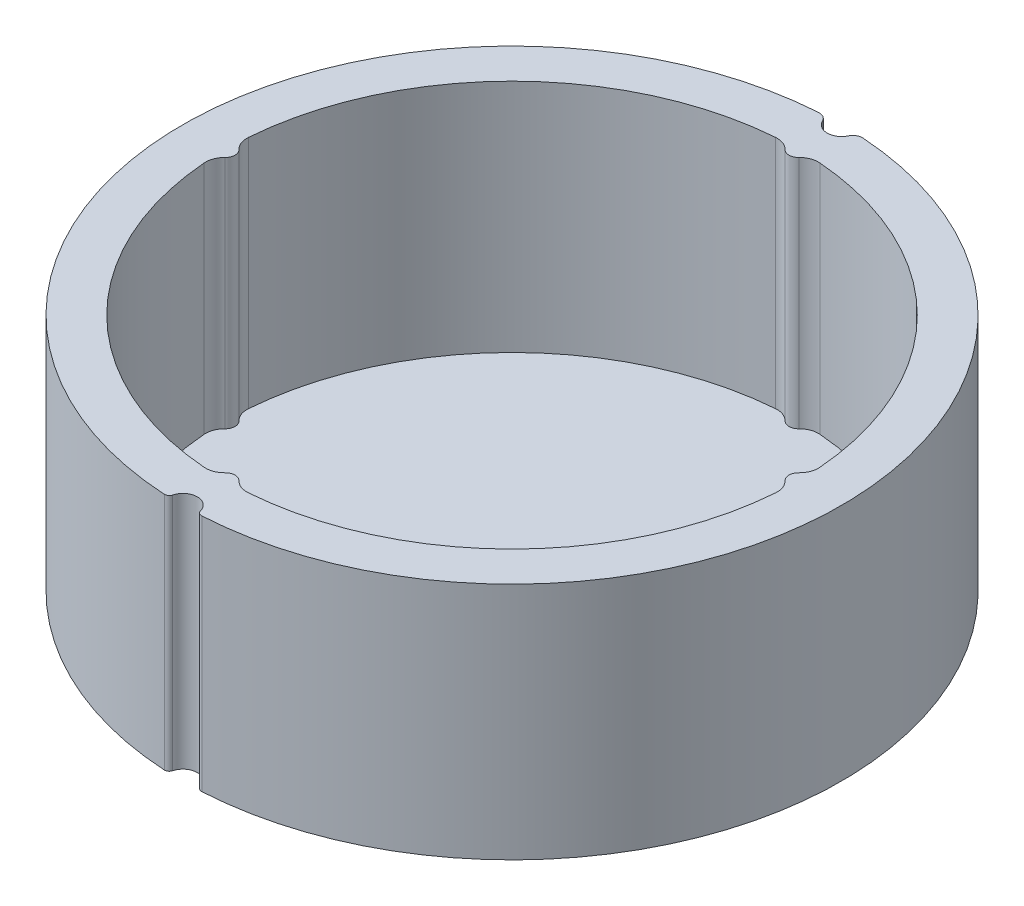
ISO-10303-21;
HEADER;
FILE_DESCRIPTION(('STEP AP214'),'2;1');
FILE_NAME('part.step','',(''),(''),'','','');
FILE_SCHEMA(('AUTOMOTIVE_DESIGN { 1 0 10303 214 1 1 1 1 }'));
ENDSEC;
DATA;
#1=APPLICATION_CONTEXT('core data for automotive mechanical design processes');
#2=APPLICATION_PROTOCOL_DEFINITION('international standard','automotive_design',2000,#1);
#3=PRODUCT_CONTEXT('',#1,'mechanical');
#4=PRODUCT('Part','Part','',(#3));
#5=PRODUCT_RELATED_PRODUCT_CATEGORY('part','',(#4));
#6=PRODUCT_DEFINITION_FORMATION('','',#4);
#7=PRODUCT_DEFINITION_CONTEXT('part definition',#1,'design');
#8=PRODUCT_DEFINITION('design','',#6,#7);
#9=PRODUCT_DEFINITION_SHAPE('','',#8);
#10=(LENGTH_UNIT() NAMED_UNIT(*) SI_UNIT(.MILLI.,.METRE.));
#11=(NAMED_UNIT(*) PLANE_ANGLE_UNIT() SI_UNIT($,.RADIAN.));
#12=(NAMED_UNIT(*) SI_UNIT($,.STERADIAN.) SOLID_ANGLE_UNIT());
#13=UNCERTAINTY_MEASURE_WITH_UNIT(LENGTH_MEASURE(1.E-05),#10,'distance_accuracy_value','');
#14=(GEOMETRIC_REPRESENTATION_CONTEXT(3) GLOBAL_UNCERTAINTY_ASSIGNED_CONTEXT((#13)) GLOBAL_UNIT_ASSIGNED_CONTEXT((#10,
#11,#12)) REPRESENTATION_CONTEXT('',''));
#15=CARTESIAN_POINT('',(0.,0.,0.));
#16=DIRECTION('',(0.,0.,1.));
#17=DIRECTION('',(1.,0.,0.));
#18=AXIS2_PLACEMENT_3D('',#15,#16,#17);
#19=CARTESIAN_POINT('',(0.,25.,0.));
#20=DIRECTION('',(0.,1.,0.));
#21=DIRECTION('',(0.,0.,1.));
#22=AXIS2_PLACEMENT_3D('',#19,#20,#21);
#23=PLANE('',#22);
#24=CARTESIAN_POINT('',(-1.93575856721061,25.,33.9428491683965));
#25=DIRECTION('',(0.,1.,0.));
#26=DIRECTION('',(0.,0.,1.));
#27=AXIS2_PLACEMENT_3D('',#24,#25,#26);
#28=CIRCLE('',#27,0.500000000000003);
#29=CARTESIAN_POINT('',(-1.45181892540796,25.,34.0685568574689));
#30=VERTEX_POINT('',#29);
#31=CARTESIAN_POINT('',(-1.96422560496371,25.,34.4420381383884));
#32=VERTEX_POINT('',#31);
#33=EDGE_CURVE('E338',#30,#32,#28,.F.);
#34=ORIENTED_EDGE('',*,*,#33,.F.);
#35=CARTESIAN_POINT('',(0.,25.,34.4456799246862));
#36=DIRECTION('',(0.,1.,0.));
#37=DIRECTION('',(0.,0.,1.));
#38=AXIS2_PLACEMENT_3D('',#35,#36,#37);
#39=CIRCLE('',#38,1.50000000000002);
#40=CARTESIAN_POINT('',(1.45181892540796,25.,34.0685568574689));
#41=VERTEX_POINT('',#40);
#42=EDGE_CURVE('E342',#41,#30,#39,.T.);
#43=ORIENTED_EDGE('',*,*,#42,.F.);
#44=CARTESIAN_POINT('',(1.93575856721061,25.,33.9428491683965));
#45=DIRECTION('',(0.,1.,0.));
#46=DIRECTION('',(0.,0.,1.));
#47=AXIS2_PLACEMENT_3D('',#44,#45,#46);
#48=CIRCLE('',#47,0.500000000000003);
#49=CARTESIAN_POINT('',(1.9642256049637,25.,34.4420381383884));
#50=VERTEX_POINT('',#49);
#51=EDGE_CURVE('E347',#41,#50,#48,.T.);
#52=ORIENTED_EDGE('',*,*,#51,.T.);
#53=CARTESIAN_POINT('',(0.,25.,-0.0020007910519898));
#54=DIRECTION('',(0.,1.,0.));
#55=DIRECTION('',(0.,0.,1.));
#56=AXIS2_PLACEMENT_3D('',#53,#54,#55);
#57=CIRCLE('',#56,34.5);
#58=CARTESIAN_POINT('',(2.32413582105506,25.,-34.4236276074198));
#59=VERTEX_POINT('',#58);
#60=EDGE_CURVE('E350',#50,#59,#57,.T.);
#61=ORIENTED_EDGE('',*,*,#60,.T.);
#62=CARTESIAN_POINT('',(2.2567695653723,25.,-33.4258992939019));
#63=DIRECTION('',(0.,1.,0.));
#64=DIRECTION('',(0.,0.,1.));
#65=AXIS2_PLACEMENT_3D('',#62,#63,#64);
#66=CIRCLE('',#65,1.);
#67=CARTESIAN_POINT('',(1.35406173922335,25.,-33.8561533823304));
#68=VERTEX_POINT('',#67);
#69=EDGE_CURVE('E353',#68,#59,#66,.F.);
#70=ORIENTED_EDGE('',*,*,#69,.F.);
#71=CARTESIAN_POINT('',(0.,25.,-34.5015345149731));
#72=DIRECTION('',(0.,1.,0.));
#73=DIRECTION('',(0.,0.,1.));
#74=AXIS2_PLACEMENT_3D('',#71,#72,#73);
#75=CIRCLE('',#74,1.49999999999991);
#76=CARTESIAN_POINT('',(-1.35406173922335,25.,-33.8561533823304));
#77=VERTEX_POINT('',#76);
#78=EDGE_CURVE('E357',#77,#68,#75,.T.);
#79=ORIENTED_EDGE('',*,*,#78,.F.);
#80=CARTESIAN_POINT('',(-2.2567695653723,25.,-33.4258992939019));
#81=DIRECTION('',(0.,1.,0.));
#82=DIRECTION('',(0.,0.,1.));
#83=AXIS2_PLACEMENT_3D('',#80,#81,#82);
#84=CIRCLE('',#83,1.);
#85=CARTESIAN_POINT('',(-2.32413582105505,25.,-34.4236276074198));
#86=VERTEX_POINT('',#85);
#87=EDGE_CURVE('E361',#77,#86,#84,.T.);
#88=ORIENTED_EDGE('',*,*,#87,.T.);
#89=CARTESIAN_POINT('',(0.,25.,-0.0020007910519898));
#90=DIRECTION('',(0.,1.,0.));
#91=DIRECTION('',(0.,0.,1.));
#92=AXIS2_PLACEMENT_3D('',#89,#90,#91);
#93=CIRCLE('',#92,34.5);
#94=EDGE_CURVE('E364',#86,#32,#93,.T.);
#95=ORIENTED_EDGE('',*,*,#94,.T.);
#96=EDGE_LOOP('',(#34,#43,#52,#61,#70,#79,#88,#95));
#97=FACE_BOUND('',#96,.T.);
#98=CARTESIAN_POINT('',(0.,25.,0.));
#99=DIRECTION('',(0.,1.,0.));
#100=DIRECTION('',(0.,0.,1.));
#101=AXIS2_PLACEMENT_3D('',#98,#99,#100);
#102=CIRCLE('',#101,30.);
#103=CARTESIAN_POINT('',(-29.9107142857143,25.,2.31282747267653));
#104=VERTEX_POINT('',#103);
#105=CARTESIAN_POINT('',(-2.31282747267654,25.,29.9107142857143));
#106=VERTEX_POINT('',#105);
#107=EDGE_CURVE('E233',#104,#106,#102,.T.);
#108=ORIENTED_EDGE('',*,*,#107,.F.);
#109=CARTESIAN_POINT('',(-27.9166666666667,25.,2.1586389744981));
#110=DIRECTION('',(0.,1.,0.));
#111=DIRECTION('',(0.,0.,1.));
#112=AXIS2_PLACEMENT_3D('',#109,#110,#111);
#113=CIRCLE('',#112,2.);
#114=CARTESIAN_POINT('',(-29.3055555555556,25.,0.7195463248327));
#115=VERTEX_POINT('',#114);
#116=EDGE_CURVE('E229',#115,#104,#113,.T.);
#117=ORIENTED_EDGE('',*,*,#116,.F.);
#118=CARTESIAN_POINT('',(-30.,25.,0.));
#119=DIRECTION('',(0.,-1.,0.));
#120=DIRECTION('',(0.,0.,1.));
#121=AXIS2_PLACEMENT_3D('',#118,#119,#120);
#122=CIRCLE('',#121,1.);
#123=CARTESIAN_POINT('',(-29.3055555555556,25.,-0.7195463248327));
#124=VERTEX_POINT('',#123);
#125=EDGE_CURVE('E211',#124,#115,#122,.T.);
#126=ORIENTED_EDGE('',*,*,#125,.F.);
#127=CARTESIAN_POINT('',(-27.9166666666667,25.,-2.1586389744981));
#128=DIRECTION('',(0.,1.,0.));
#129=DIRECTION('',(0.,0.,-1.));
#130=AXIS2_PLACEMENT_3D('',#127,#128,#129);
#131=CIRCLE('',#130,2.);
#132=CARTESIAN_POINT('',(-29.9107142857143,25.,-2.31282747267654));
#133=VERTEX_POINT('',#132);
#134=EDGE_CURVE('E277',#133,#124,#131,.T.);
#135=ORIENTED_EDGE('',*,*,#134,.F.);
#136=CARTESIAN_POINT('',(0.,25.,0.));
#137=DIRECTION('',(0.,1.,0.));
#138=DIRECTION('',(0.,0.,1.));
#139=AXIS2_PLACEMENT_3D('',#136,#137,#138);
#140=CIRCLE('',#139,30.);
#141=CARTESIAN_POINT('',(-2.31282747267652,25.,-29.9107142857143));
#142=VERTEX_POINT('',#141);
#143=EDGE_CURVE('E274',#142,#133,#140,.T.);
#144=ORIENTED_EDGE('',*,*,#143,.F.);
#145=CARTESIAN_POINT('',(-2.1586389744981,25.,-27.9166666666667));
#146=DIRECTION('',(0.,1.,0.));
#147=DIRECTION('',(0.,0.,1.));
#148=AXIS2_PLACEMENT_3D('',#145,#146,#147);
#149=CIRCLE('',#148,2.);
#150=CARTESIAN_POINT('',(-0.719546324832698,25.,-29.3055555555556));
#151=VERTEX_POINT('',#150);
#152=EDGE_CURVE('E271',#151,#142,#149,.T.);
#153=ORIENTED_EDGE('',*,*,#152,.F.);
#154=CARTESIAN_POINT('',(0.,25.,-30.));
#155=DIRECTION('',(0.,-1.,0.));
#156=DIRECTION('',(0.,0.,1.));
#157=AXIS2_PLACEMENT_3D('',#154,#155,#156);
#158=CIRCLE('',#157,1.);
#159=CARTESIAN_POINT('',(0.7195463248327,25.,-29.3055555555556));
#160=VERTEX_POINT('',#159);
#161=EDGE_CURVE('E268',#160,#151,#158,.T.);
#162=ORIENTED_EDGE('',*,*,#161,.F.);
#163=CARTESIAN_POINT('',(2.1586389744981,25.,-27.9166666666667));
#164=DIRECTION('',(0.,1.,0.));
#165=DIRECTION('',(0.,0.,-1.));
#166=AXIS2_PLACEMENT_3D('',#163,#164,#165);
#167=CIRCLE('',#166,2.);
#168=CARTESIAN_POINT('',(2.31282747267654,25.,-29.9107142857143));
#169=VERTEX_POINT('',#168);
#170=EDGE_CURVE('E265',#169,#160,#167,.T.);
#171=ORIENTED_EDGE('',*,*,#170,.F.);
#172=CARTESIAN_POINT('',(0.,25.,0.));
#173=DIRECTION('',(0.,1.,0.));
#174=DIRECTION('',(0.,0.,1.));
#175=AXIS2_PLACEMENT_3D('',#172,#173,#174);
#176=CIRCLE('',#175,30.);
#177=CARTESIAN_POINT('',(29.9107142857143,25.,-2.31282747267654));
#178=VERTEX_POINT('',#177);
#179=EDGE_CURVE('E262',#178,#169,#176,.T.);
#180=ORIENTED_EDGE('',*,*,#179,.F.);
#181=CARTESIAN_POINT('',(27.9166666666667,25.,-2.1586389744981));
#182=DIRECTION('',(0.,1.,0.));
#183=DIRECTION('',(0.,0.,1.));
#184=AXIS2_PLACEMENT_3D('',#181,#182,#183);
#185=CIRCLE('',#184,2.);
#186=CARTESIAN_POINT('',(29.3055555555556,25.,-0.719546324832698));
#187=VERTEX_POINT('',#186);
#188=EDGE_CURVE('E259',#187,#178,#185,.T.);
#189=ORIENTED_EDGE('',*,*,#188,.F.);
#190=CARTESIAN_POINT('',(30.,25.,0.));
#191=DIRECTION('',(0.,-1.,0.));
#192=DIRECTION('',(0.,0.,1.));
#193=AXIS2_PLACEMENT_3D('',#190,#191,#192);
#194=CIRCLE('',#193,1.);
#195=CARTESIAN_POINT('',(29.3055555555556,25.,0.7195463248327));
#196=VERTEX_POINT('',#195);
#197=EDGE_CURVE('E256',#196,#187,#194,.T.);
#198=ORIENTED_EDGE('',*,*,#197,.F.);
#199=CARTESIAN_POINT('',(27.9166666666667,25.,2.1586389744981));
#200=DIRECTION('',(0.,1.,0.));
#201=DIRECTION('',(0.,0.,-1.));
#202=AXIS2_PLACEMENT_3D('',#199,#200,#201);
#203=CIRCLE('',#202,2.);
#204=CARTESIAN_POINT('',(29.9107142857143,25.,2.31282747267654));
#205=VERTEX_POINT('',#204);
#206=EDGE_CURVE('E253',#205,#196,#203,.T.);
#207=ORIENTED_EDGE('',*,*,#206,.F.);
#208=CARTESIAN_POINT('',(0.,25.,0.));
#209=DIRECTION('',(0.,1.,0.));
#210=DIRECTION('',(0.,0.,1.));
#211=AXIS2_PLACEMENT_3D('',#208,#209,#210);
#212=CIRCLE('',#211,30.);
#213=CARTESIAN_POINT('',(2.31282747267654,25.,29.9107142857143));
#214=VERTEX_POINT('',#213);
#215=EDGE_CURVE('E250',#214,#205,#212,.T.);
#216=ORIENTED_EDGE('',*,*,#215,.F.);
#217=CARTESIAN_POINT('',(2.1586389744981,25.,27.9166666666667));
#218=DIRECTION('',(0.,1.,0.));
#219=DIRECTION('',(0.,0.,1.));
#220=AXIS2_PLACEMENT_3D('',#217,#218,#219);
#221=CIRCLE('',#220,2.);
#222=CARTESIAN_POINT('',(0.719546324832698,25.,29.3055555555556));
#223=VERTEX_POINT('',#222);
#224=EDGE_CURVE('E247',#223,#214,#221,.T.);
#225=ORIENTED_EDGE('',*,*,#224,.F.);
#226=CARTESIAN_POINT('',(0.,25.,30.));
#227=DIRECTION('',(0.,-1.,0.));
#228=DIRECTION('',(0.,0.,1.));
#229=AXIS2_PLACEMENT_3D('',#226,#227,#228);
#230=CIRCLE('',#229,1.);
#231=CARTESIAN_POINT('',(-0.7195463248327,25.,29.3055555555556));
#232=VERTEX_POINT('',#231);
#233=EDGE_CURVE('E244',#232,#223,#230,.T.);
#234=ORIENTED_EDGE('',*,*,#233,.F.);
#235=CARTESIAN_POINT('',(-2.1586389744981,25.,27.9166666666667));
#236=DIRECTION('',(0.,1.,0.));
#237=DIRECTION('',(0.,0.,-1.));
#238=AXIS2_PLACEMENT_3D('',#235,#236,#237);
#239=CIRCLE('',#238,2.);
#240=EDGE_CURVE('E241',#106,#232,#239,.T.);
#241=ORIENTED_EDGE('',*,*,#240,.F.);
#242=EDGE_LOOP('',(#108,#117,#126,#135,#144,#153,#162,#171,#180,#189,#198,#207,#216,#225,#234,#241));
#243=FACE_BOUND('',#242,.T.);
#244=ADVANCED_FACE('F41',(#97,#243),#23,.T.);
#245=CARTESIAN_POINT('',(0.,0.,0.));
#246=DIRECTION('',(0.,1.,0.));
#247=DIRECTION('',(0.,0.,1.));
#248=AXIS2_PLACEMENT_3D('',#245,#246,#247);
#249=PLANE('',#248);
#250=CARTESIAN_POINT('',(-1.93575856721061,0.,33.9428491683965));
#251=DIRECTION('',(0.,1.,0.));
#252=DIRECTION('',(0.,0.,1.));
#253=AXIS2_PLACEMENT_3D('',#250,#251,#252);
#254=CIRCLE('',#253,0.500000000000003);
#255=CARTESIAN_POINT('',(-1.45181892540796,0.,34.0685568574689));
#256=VERTEX_POINT('',#255);
#257=CARTESIAN_POINT('',(-1.96422560496371,0.,34.4420381383884));
#258=VERTEX_POINT('',#257);
#259=EDGE_CURVE('E337',#256,#258,#254,.F.);
#260=ORIENTED_EDGE('',*,*,#259,.T.);
#261=CARTESIAN_POINT('',(0.,0.,-0.0020007910519898));
#262=DIRECTION('',(0.,1.,0.));
#263=DIRECTION('',(0.,0.,1.));
#264=AXIS2_PLACEMENT_3D('',#261,#262,#263);
#265=CIRCLE('',#264,34.5);
#266=CARTESIAN_POINT('',(-2.32413582105505,0.,-34.4236276074198));
#267=VERTEX_POINT('',#266);
#268=EDGE_CURVE('E343',#267,#258,#265,.T.);
#269=ORIENTED_EDGE('',*,*,#268,.F.);
#270=CARTESIAN_POINT('',(-2.2567695653723,0.,-33.4258992939019));
#271=DIRECTION('',(0.,1.,0.));
#272=DIRECTION('',(0.,0.,1.));
#273=AXIS2_PLACEMENT_3D('',#270,#271,#272);
#274=CIRCLE('',#273,1.);
#275=CARTESIAN_POINT('',(-1.35406173922335,0.,-33.8561533823304));
#276=VERTEX_POINT('',#275);
#277=EDGE_CURVE('E390',#276,#267,#274,.T.);
#278=ORIENTED_EDGE('',*,*,#277,.F.);
#279=CARTESIAN_POINT('',(0.,0.,-34.5015345149731));
#280=DIRECTION('',(0.,1.,0.));
#281=DIRECTION('',(0.,0.,1.));
#282=AXIS2_PLACEMENT_3D('',#279,#280,#281);
#283=CIRCLE('',#282,1.49999999999991);
#284=CARTESIAN_POINT('',(1.35406173922335,0.,-33.8561533823304));
#285=VERTEX_POINT('',#284);
#286=EDGE_CURVE('E386',#276,#285,#283,.T.);
#287=ORIENTED_EDGE('',*,*,#286,.T.);
#288=CARTESIAN_POINT('',(2.2567695653723,0.,-33.4258992939019));
#289=DIRECTION('',(0.,1.,0.));
#290=DIRECTION('',(0.,0.,1.));
#291=AXIS2_PLACEMENT_3D('',#288,#289,#290);
#292=CIRCLE('',#291,1.);
#293=CARTESIAN_POINT('',(2.32413582105506,0.,-34.4236276074198));
#294=VERTEX_POINT('',#293);
#295=EDGE_CURVE('E382',#285,#294,#292,.F.);
#296=ORIENTED_EDGE('',*,*,#295,.T.);
#297=CARTESIAN_POINT('',(0.,0.,-0.0020007910519898));
#298=DIRECTION('',(0.,1.,0.));
#299=DIRECTION('',(0.,0.,1.));
#300=AXIS2_PLACEMENT_3D('',#297,#298,#299);
#301=CIRCLE('',#300,34.5);
#302=CARTESIAN_POINT('',(1.9642256049637,0.,34.4420381383884));
#303=VERTEX_POINT('',#302);
#304=EDGE_CURVE('E378',#303,#294,#301,.T.);
#305=ORIENTED_EDGE('',*,*,#304,.F.);
#306=CARTESIAN_POINT('',(1.93575856721061,0.,33.9428491683965));
#307=DIRECTION('',(0.,1.,0.));
#308=DIRECTION('',(0.,0.,1.));
#309=AXIS2_PLACEMENT_3D('',#306,#307,#308);
#310=CIRCLE('',#309,0.500000000000003);
#311=CARTESIAN_POINT('',(1.45181892540796,0.,34.0685568574689));
#312=VERTEX_POINT('',#311);
#313=EDGE_CURVE('E375',#312,#303,#310,.T.);
#314=ORIENTED_EDGE('',*,*,#313,.F.);
#315=CARTESIAN_POINT('',(0.,0.,34.4456799246862));
#316=DIRECTION('',(0.,1.,0.));
#317=DIRECTION('',(0.,0.,1.));
#318=AXIS2_PLACEMENT_3D('',#315,#316,#317);
#319=CIRCLE('',#318,1.50000000000002);
#320=EDGE_CURVE('E371',#312,#256,#319,.T.);
#321=ORIENTED_EDGE('',*,*,#320,.T.);
#322=EDGE_LOOP('',(#260,#269,#278,#287,#296,#305,#314,#321));
#323=FACE_BOUND('',#322,.T.);
#324=ADVANCED_FACE('F425',(#323),#249,.F.);
#325=CARTESIAN_POINT('',(-1.93575856721061,25.,33.9428491683965));
#326=DIRECTION('',(0.,-1.,0.));
#327=DIRECTION('',(0.,0.,-1.));
#328=AXIS2_PLACEMENT_3D('',#325,#326,#327);
#329=CYLINDRICAL_SURFACE('',#328,0.500000000000003);
#330=ORIENTED_EDGE('',*,*,#259,.F.);
#331=DIRECTION('',(0.,-1.,0.));
#332=VECTOR('',#331,1.);
#333=CARTESIAN_POINT('',(-1.45181892540796,25.,34.0685568574689));
#334=LINE('',#333,#332);
#335=EDGE_CURVE('E11',#30,#256,#334,.T.);
#336=ORIENTED_EDGE('',*,*,#335,.F.);
#337=ORIENTED_EDGE('',*,*,#33,.T.);
#338=DIRECTION('',(0.,-1.,0.));
#339=VECTOR('',#338,1.);
#340=CARTESIAN_POINT('',(-1.96422560496371,25.,34.4420381383884));
#341=LINE('',#340,#339);
#342=EDGE_CURVE('E367',#32,#258,#341,.T.);
#343=ORIENTED_EDGE('',*,*,#342,.T.);
#344=EDGE_LOOP('',(#330,#336,#337,#343));
#345=FACE_BOUND('',#344,.T.);
#346=ADVANCED_FACE('F43',(#345),#329,.T.);
#347=CARTESIAN_POINT('',(0.,25.,34.4456799246862));
#348=DIRECTION('',(0.,-1.,0.));
#349=DIRECTION('',(0.,0.,-1.));
#350=AXIS2_PLACEMENT_3D('',#347,#348,#349);
#351=CYLINDRICAL_SURFACE('',#350,1.50000000000002);
#352=ORIENTED_EDGE('',*,*,#320,.F.);
#353=DIRECTION('',(0.,-1.,0.));
#354=VECTOR('',#353,1.);
#355=CARTESIAN_POINT('',(1.45181892540796,25.,34.0685568574689));
#356=LINE('',#355,#354);
#357=EDGE_CURVE('E50',#41,#312,#356,.T.);
#358=ORIENTED_EDGE('',*,*,#357,.F.);
#359=ORIENTED_EDGE('',*,*,#42,.T.);
#360=ORIENTED_EDGE('',*,*,#335,.T.);
#361=EDGE_LOOP('',(#352,#358,#359,#360));
#362=FACE_BOUND('',#361,.T.);
#363=ADVANCED_FACE('F426',(#362),#351,.F.);
#364=CARTESIAN_POINT('',(1.93575856721061,25.,33.9428491683965));
#365=DIRECTION('',(0.,-1.,0.));
#366=DIRECTION('',(0.,0.,-1.));
#367=AXIS2_PLACEMENT_3D('',#364,#365,#366);
#368=CYLINDRICAL_SURFACE('',#367,0.500000000000003);
#369=ORIENTED_EDGE('',*,*,#313,.T.);
#370=DIRECTION('',(0.,-1.,0.));
#371=VECTOR('',#370,1.);
#372=CARTESIAN_POINT('',(1.9642256049637,25.,34.4420381383884));
#373=LINE('',#372,#371);
#374=EDGE_CURVE('E411',#50,#303,#373,.T.);
#375=ORIENTED_EDGE('',*,*,#374,.F.);
#376=ORIENTED_EDGE('',*,*,#51,.F.);
#377=ORIENTED_EDGE('',*,*,#357,.T.);
#378=EDGE_LOOP('',(#369,#375,#376,#377));
#379=FACE_BOUND('',#378,.T.);
#380=ADVANCED_FACE('F418',(#379),#368,.T.);
#381=CARTESIAN_POINT('',(0.,25.,-0.0020007910519898));
#382=DIRECTION('',(0.,-1.,0.));
#383=DIRECTION('',(0.,0.,-1.));
#384=AXIS2_PLACEMENT_3D('',#381,#382,#383);
#385=CYLINDRICAL_SURFACE('',#384,34.5);
#386=ORIENTED_EDGE('',*,*,#304,.T.);
#387=DIRECTION('',(0.,-1.,0.));
#388=VECTOR('',#387,1.);
#389=CARTESIAN_POINT('',(2.32413582105506,25.,-34.4236276074198));
#390=LINE('',#389,#388);
#391=EDGE_CURVE('E408',#59,#294,#390,.T.);
#392=ORIENTED_EDGE('',*,*,#391,.F.);
#393=ORIENTED_EDGE('',*,*,#60,.F.);
#394=ORIENTED_EDGE('',*,*,#374,.T.);
#395=EDGE_LOOP('',(#386,#392,#393,#394));
#396=FACE_BOUND('',#395,.T.);
#397=ADVANCED_FACE('F451',(#396),#385,.T.);
#398=CARTESIAN_POINT('',(2.2567695653723,25.,-33.4258992939019));
#399=DIRECTION('',(0.,-1.,0.));
#400=DIRECTION('',(0.,0.,-1.));
#401=AXIS2_PLACEMENT_3D('',#398,#399,#400);
#402=CYLINDRICAL_SURFACE('',#401,1.);
#403=ORIENTED_EDGE('',*,*,#295,.F.);
#404=DIRECTION('',(0.,-1.,0.));
#405=VECTOR('',#404,1.);
#406=CARTESIAN_POINT('',(1.35406173922335,25.,-33.8561533823304));
#407=LINE('',#406,#405);
#408=EDGE_CURVE('E405',#68,#285,#407,.T.);
#409=ORIENTED_EDGE('',*,*,#408,.F.);
#410=ORIENTED_EDGE('',*,*,#69,.T.);
#411=ORIENTED_EDGE('',*,*,#391,.T.);
#412=EDGE_LOOP('',(#403,#409,#410,#411));
#413=FACE_BOUND('',#412,.T.);
#414=ADVANCED_FACE('F446',(#413),#402,.T.);
#415=CARTESIAN_POINT('',(0.,25.,-34.5015345149731));
#416=DIRECTION('',(0.,-1.,0.));
#417=DIRECTION('',(0.,0.,-1.));
#418=AXIS2_PLACEMENT_3D('',#415,#416,#417);
#419=CYLINDRICAL_SURFACE('',#418,1.49999999999991);
#420=ORIENTED_EDGE('',*,*,#286,.F.);
#421=DIRECTION('',(0.,-1.,0.));
#422=VECTOR('',#421,1.);
#423=CARTESIAN_POINT('',(-1.35406173922335,25.,-33.8561533823304));
#424=LINE('',#423,#422);
#425=EDGE_CURVE('E402',#77,#276,#424,.T.);
#426=ORIENTED_EDGE('',*,*,#425,.F.);
#427=ORIENTED_EDGE('',*,*,#78,.T.);
#428=ORIENTED_EDGE('',*,*,#408,.T.);
#429=EDGE_LOOP('',(#420,#426,#427,#428));
#430=FACE_BOUND('',#429,.T.);
#431=ADVANCED_FACE('F443',(#430),#419,.F.);
#432=CARTESIAN_POINT('',(-2.2567695653723,25.,-33.4258992939019));
#433=DIRECTION('',(0.,-1.,0.));
#434=DIRECTION('',(0.,0.,-1.));
#435=AXIS2_PLACEMENT_3D('',#432,#433,#434);
#436=CYLINDRICAL_SURFACE('',#435,1.);
#437=ORIENTED_EDGE('',*,*,#277,.T.);
#438=DIRECTION('',(0.,-1.,0.));
#439=VECTOR('',#438,1.);
#440=CARTESIAN_POINT('',(-2.32413582105505,25.,-34.4236276074198));
#441=LINE('',#440,#439);
#442=EDGE_CURVE('E398',#86,#267,#441,.T.);
#443=ORIENTED_EDGE('',*,*,#442,.F.);
#444=ORIENTED_EDGE('',*,*,#87,.F.);
#445=ORIENTED_EDGE('',*,*,#425,.T.);
#446=EDGE_LOOP('',(#437,#443,#444,#445));
#447=FACE_BOUND('',#446,.T.);
#448=ADVANCED_FACE('F440',(#447),#436,.T.);
#449=CARTESIAN_POINT('',(0.,25.,-0.0020007910519898));
#450=DIRECTION('',(0.,-1.,0.));
#451=DIRECTION('',(0.,0.,-1.));
#452=AXIS2_PLACEMENT_3D('',#449,#450,#451);
#453=CYLINDRICAL_SURFACE('',#452,34.5);
#454=ORIENTED_EDGE('',*,*,#268,.T.);
#455=ORIENTED_EDGE('',*,*,#342,.F.);
#456=ORIENTED_EDGE('',*,*,#94,.F.);
#457=ORIENTED_EDGE('',*,*,#442,.T.);
#458=EDGE_LOOP('',(#454,#455,#456,#457));
#459=FACE_BOUND('',#458,.T.);
#460=ADVANCED_FACE('F435',(#459),#453,.T.);
#461=CARTESIAN_POINT('',(-27.9166666666667,25.,2.1586389744981));
#462=DIRECTION('',(0.,-1.,0.));
#463=DIRECTION('',(0.,0.,-1.));
#464=AXIS2_PLACEMENT_3D('',#461,#462,#463);
#465=CYLINDRICAL_SURFACE('',#464,2.);
#466=CARTESIAN_POINT('',(-27.9166666666667,0.4,2.1586389744981));
#467=DIRECTION('',(0.,1.,0.));
#468=DIRECTION('',(0.,0.,1.));
#469=AXIS2_PLACEMENT_3D('',#466,#467,#468);
#470=CIRCLE('',#469,2.);
#471=CARTESIAN_POINT('',(-29.3055555555556,0.4,0.7195463248327));
#472=VERTEX_POINT('',#471);
#473=CARTESIAN_POINT('',(-29.9107142857143,0.400000000000001,2.31282747267653));
#474=VERTEX_POINT('',#473);
#475=EDGE_CURVE('E218',#472,#474,#470,.T.);
#476=ORIENTED_EDGE('',*,*,#475,.F.);
#477=DIRECTION('',(0.,-1.,0.));
#478=VECTOR('',#477,1.);
#479=CARTESIAN_POINT('',(-29.3055555555556,25.,0.7195463248327));
#480=LINE('',#479,#478);
#481=EDGE_CURVE('E204',#115,#472,#480,.T.);
#482=ORIENTED_EDGE('',*,*,#481,.F.);
#483=ORIENTED_EDGE('',*,*,#116,.T.);
#484=DIRECTION('',(0.,-1.,0.));
#485=VECTOR('',#484,1.);
#486=CARTESIAN_POINT('',(-29.9107142857143,25.,2.31282747267653));
#487=LINE('',#486,#485);
#488=EDGE_CURVE('E220',#104,#474,#487,.T.);
#489=ORIENTED_EDGE('',*,*,#488,.T.);
#490=EDGE_LOOP('',(#476,#482,#483,#489));
#491=FACE_BOUND('',#490,.T.);
#492=ADVANCED_FACE('F219',(#491),#465,.F.);
#493=CARTESIAN_POINT('',(0.,25.,0.));
#494=DIRECTION('',(0.,-1.,0.));
#495=DIRECTION('',(0.,0.,-1.));
#496=AXIS2_PLACEMENT_3D('',#493,#494,#495);
#497=CYLINDRICAL_SURFACE('',#496,30.);
#498=CARTESIAN_POINT('',(0.,0.4,0.));
#499=DIRECTION('',(0.,1.,0.));
#500=DIRECTION('',(0.,0.,1.));
#501=AXIS2_PLACEMENT_3D('',#498,#499,#500);
#502=CIRCLE('',#501,30.);
#503=CARTESIAN_POINT('',(-2.31282747267654,0.400000000000001,29.9107142857143));
#504=VERTEX_POINT('',#503);
#505=EDGE_CURVE('E57',#474,#504,#502,.T.);
#506=ORIENTED_EDGE('',*,*,#505,.F.);
#507=ORIENTED_EDGE('',*,*,#488,.F.);
#508=ORIENTED_EDGE('',*,*,#107,.T.);
#509=DIRECTION('',(0.,-1.,0.));
#510=VECTOR('',#509,1.);
#511=CARTESIAN_POINT('',(-2.31282747267654,25.,29.9107142857143));
#512=LINE('',#511,#510);
#513=EDGE_CURVE('E332',#106,#504,#512,.T.);
#514=ORIENTED_EDGE('',*,*,#513,.T.);
#515=EDGE_LOOP('',(#506,#507,#508,#514));
#516=FACE_BOUND('',#515,.T.);
#517=ADVANCED_FACE('F459',(#516),#497,.F.);
#518=CARTESIAN_POINT('',(-2.1586389744981,25.,27.9166666666667));
#519=DIRECTION('',(0.,-1.,0.));
#520=DIRECTION('',(0.,0.,-1.));
#521=AXIS2_PLACEMENT_3D('',#518,#519,#520);
#522=CYLINDRICAL_SURFACE('',#521,2.);
#523=CARTESIAN_POINT('',(-2.1586389744981,0.4,27.9166666666667));
#524=DIRECTION('',(0.,1.,0.));
#525=DIRECTION('',(0.,0.,-1.));
#526=AXIS2_PLACEMENT_3D('',#523,#524,#525);
#527=CIRCLE('',#526,2.);
#528=CARTESIAN_POINT('',(-0.7195463248327,0.400000000000001,29.3055555555556));
#529=VERTEX_POINT('',#528);
#530=EDGE_CURVE('E65',#504,#529,#527,.T.);
#531=ORIENTED_EDGE('',*,*,#530,.F.);
#532=ORIENTED_EDGE('',*,*,#513,.F.);
#533=ORIENTED_EDGE('',*,*,#240,.T.);
#534=DIRECTION('',(0.,-1.,0.));
#535=VECTOR('',#534,1.);
#536=CARTESIAN_POINT('',(-0.7195463248327,25.,29.3055555555556));
#537=LINE('',#536,#535);
#538=EDGE_CURVE('E329',#232,#529,#537,.T.);
#539=ORIENTED_EDGE('',*,*,#538,.T.);
#540=EDGE_LOOP('',(#531,#532,#533,#539));
#541=FACE_BOUND('',#540,.T.);
#542=ADVANCED_FACE('F460',(#541),#522,.F.);
#543=CARTESIAN_POINT('',(0.,25.,30.));
#544=DIRECTION('',(0.,-1.,0.));
#545=DIRECTION('',(0.,0.,-1.));
#546=AXIS2_PLACEMENT_3D('',#543,#544,#545);
#547=CYLINDRICAL_SURFACE('',#546,1.);
#548=CARTESIAN_POINT('',(0.,0.4,30.));
#549=DIRECTION('',(0.,-1.,0.));
#550=DIRECTION('',(0.,0.,1.));
#551=AXIS2_PLACEMENT_3D('',#548,#549,#550);
#552=CIRCLE('',#551,1.);
#553=CARTESIAN_POINT('',(0.719546324832698,0.400000000000001,29.3055555555556));
#554=VERTEX_POINT('',#553);
#555=EDGE_CURVE('E466',#529,#554,#552,.T.);
#556=ORIENTED_EDGE('',*,*,#555,.F.);
#557=ORIENTED_EDGE('',*,*,#538,.F.);
#558=ORIENTED_EDGE('',*,*,#233,.T.);
#559=DIRECTION('',(0.,-1.,0.));
#560=VECTOR('',#559,1.);
#561=CARTESIAN_POINT('',(0.719546324832698,25.,29.3055555555556));
#562=LINE('',#561,#560);
#563=EDGE_CURVE('E325',#223,#554,#562,.T.);
#564=ORIENTED_EDGE('',*,*,#563,.T.);
#565=EDGE_LOOP('',(#556,#557,#558,#564));
#566=FACE_BOUND('',#565,.T.);
#567=ADVANCED_FACE('F463',(#566),#547,.T.);
#568=CARTESIAN_POINT('',(2.1586389744981,25.,27.9166666666667));
#569=DIRECTION('',(0.,-1.,0.));
#570=DIRECTION('',(0.,0.,-1.));
#571=AXIS2_PLACEMENT_3D('',#568,#569,#570);
#572=CYLINDRICAL_SURFACE('',#571,2.);
#573=CARTESIAN_POINT('',(2.1586389744981,0.4,27.9166666666667));
#574=DIRECTION('',(0.,1.,0.));
#575=DIRECTION('',(0.,0.,1.));
#576=AXIS2_PLACEMENT_3D('',#573,#574,#575);
#577=CIRCLE('',#576,2.);
#578=CARTESIAN_POINT('',(2.31282747267654,0.400000000000001,29.9107142857143));
#579=VERTEX_POINT('',#578);
#580=EDGE_CURVE('E482',#554,#579,#577,.T.);
#581=ORIENTED_EDGE('',*,*,#580,.F.);
#582=ORIENTED_EDGE('',*,*,#563,.F.);
#583=ORIENTED_EDGE('',*,*,#224,.T.);
#584=DIRECTION('',(0.,-1.,0.));
#585=VECTOR('',#584,1.);
#586=CARTESIAN_POINT('',(2.31282747267654,25.,29.9107142857143));
#587=LINE('',#586,#585);
#588=EDGE_CURVE('E321',#214,#579,#587,.T.);
#589=ORIENTED_EDGE('',*,*,#588,.T.);
#590=EDGE_LOOP('',(#581,#582,#583,#589));
#591=FACE_BOUND('',#590,.T.);
#592=ADVANCED_FACE('F472',(#591),#572,.F.);
#593=CARTESIAN_POINT('',(0.,25.,0.));
#594=DIRECTION('',(0.,-1.,0.));
#595=DIRECTION('',(0.,0.,-1.));
#596=AXIS2_PLACEMENT_3D('',#593,#594,#595);
#597=CYLINDRICAL_SURFACE('',#596,30.);
#598=CARTESIAN_POINT('',(0.,0.4,0.));
#599=DIRECTION('',(0.,1.,0.));
#600=DIRECTION('',(0.,0.,1.));
#601=AXIS2_PLACEMENT_3D('',#598,#599,#600);
#602=CIRCLE('',#601,30.);
#603=CARTESIAN_POINT('',(29.9107142857143,0.400000000000001,2.31282747267654));
#604=VERTEX_POINT('',#603);
#605=EDGE_CURVE('E478',#579,#604,#602,.T.);
#606=ORIENTED_EDGE('',*,*,#605,.F.);
#607=ORIENTED_EDGE('',*,*,#588,.F.);
#608=ORIENTED_EDGE('',*,*,#215,.T.);
#609=DIRECTION('',(0.,-1.,0.));
#610=VECTOR('',#609,1.);
#611=CARTESIAN_POINT('',(29.9107142857143,25.,2.31282747267654));
#612=LINE('',#611,#610);
#613=EDGE_CURVE('E317',#205,#604,#612,.T.);
#614=ORIENTED_EDGE('',*,*,#613,.T.);
#615=EDGE_LOOP('',(#606,#607,#608,#614));
#616=FACE_BOUND('',#615,.T.);
#617=ADVANCED_FACE('F475',(#616),#597,.F.);
#618=CARTESIAN_POINT('',(27.9166666666667,25.,2.1586389744981));
#619=DIRECTION('',(0.,-1.,0.));
#620=DIRECTION('',(0.,0.,-1.));
#621=AXIS2_PLACEMENT_3D('',#618,#619,#620);
#622=CYLINDRICAL_SURFACE('',#621,2.);
#623=CARTESIAN_POINT('',(27.9166666666667,0.4,2.1586389744981));
#624=DIRECTION('',(0.,1.,0.));
#625=DIRECTION('',(0.,0.,-1.));
#626=AXIS2_PLACEMENT_3D('',#623,#624,#625);
#627=CIRCLE('',#626,2.);
#628=CARTESIAN_POINT('',(29.3055555555556,0.400000000000001,0.7195463248327));
#629=VERTEX_POINT('',#628);
#630=EDGE_CURVE('E481',#604,#629,#627,.T.);
#631=ORIENTED_EDGE('',*,*,#630,.F.);
#632=ORIENTED_EDGE('',*,*,#613,.F.);
#633=ORIENTED_EDGE('',*,*,#206,.T.);
#634=DIRECTION('',(0.,-1.,0.));
#635=VECTOR('',#634,1.);
#636=CARTESIAN_POINT('',(29.3055555555556,25.,0.7195463248327));
#637=LINE('',#636,#635);
#638=EDGE_CURVE('E313',#196,#629,#637,.T.);
#639=ORIENTED_EDGE('',*,*,#638,.T.);
#640=EDGE_LOOP('',(#631,#632,#633,#639));
#641=FACE_BOUND('',#640,.T.);
#642=ADVANCED_FACE('F559',(#641),#622,.F.);
#643=CARTESIAN_POINT('',(30.,25.,0.));
#644=DIRECTION('',(0.,-1.,0.));
#645=DIRECTION('',(0.,0.,-1.));
#646=AXIS2_PLACEMENT_3D('',#643,#644,#645);
#647=CYLINDRICAL_SURFACE('',#646,1.);
#648=CARTESIAN_POINT('',(30.,0.4,0.));
#649=DIRECTION('',(0.,-1.,0.));
#650=DIRECTION('',(0.,0.,1.));
#651=AXIS2_PLACEMENT_3D('',#648,#649,#650);
#652=CIRCLE('',#651,1.);
#653=CARTESIAN_POINT('',(29.3055555555556,0.400000000000001,-0.719546324832698));
#654=VERTEX_POINT('',#653);
#655=EDGE_CURVE('E486',#629,#654,#652,.T.);
#656=ORIENTED_EDGE('',*,*,#655,.F.);
#657=ORIENTED_EDGE('',*,*,#638,.F.);
#658=ORIENTED_EDGE('',*,*,#197,.T.);
#659=DIRECTION('',(0.,-1.,0.));
#660=VECTOR('',#659,1.);
#661=CARTESIAN_POINT('',(29.3055555555556,25.,-0.719546324832698));
#662=LINE('',#661,#660);
#663=EDGE_CURVE('E309',#187,#654,#662,.T.);
#664=ORIENTED_EDGE('',*,*,#663,.T.);
#665=EDGE_LOOP('',(#656,#657,#658,#664));
#666=FACE_BOUND('',#665,.T.);
#667=ADVANCED_FACE('F555',(#666),#647,.T.);
#668=CARTESIAN_POINT('',(27.9166666666667,25.,-2.1586389744981));
#669=DIRECTION('',(0.,-1.,0.));
#670=DIRECTION('',(0.,0.,-1.));
#671=AXIS2_PLACEMENT_3D('',#668,#669,#670);
#672=CYLINDRICAL_SURFACE('',#671,2.);
#673=CARTESIAN_POINT('',(27.9166666666667,0.4,-2.1586389744981));
#674=DIRECTION('',(0.,1.,0.));
#675=DIRECTION('',(0.,0.,1.));
#676=AXIS2_PLACEMENT_3D('',#673,#674,#675);
#677=CIRCLE('',#676,2.);
#678=CARTESIAN_POINT('',(29.9107142857143,0.400000000000001,-2.31282747267654));
#679=VERTEX_POINT('',#678);
#680=EDGE_CURVE('E494',#654,#679,#677,.T.);
#681=ORIENTED_EDGE('',*,*,#680,.F.);
#682=ORIENTED_EDGE('',*,*,#663,.F.);
#683=ORIENTED_EDGE('',*,*,#188,.T.);
#684=DIRECTION('',(0.,-1.,0.));
#685=VECTOR('',#684,1.);
#686=CARTESIAN_POINT('',(29.9107142857143,25.,-2.31282747267654));
#687=LINE('',#686,#685);
#688=EDGE_CURVE('E305',#178,#679,#687,.T.);
#689=ORIENTED_EDGE('',*,*,#688,.T.);
#690=EDGE_LOOP('',(#681,#682,#683,#689));
#691=FACE_BOUND('',#690,.T.);
#692=ADVANCED_FACE('F551',(#691),#672,.F.);
#693=CARTESIAN_POINT('',(0.,25.,0.));
#694=DIRECTION('',(0.,-1.,0.));
#695=DIRECTION('',(0.,0.,-1.));
#696=AXIS2_PLACEMENT_3D('',#693,#694,#695);
#697=CYLINDRICAL_SURFACE('',#696,30.);
#698=CARTESIAN_POINT('',(0.,0.4,0.));
#699=DIRECTION('',(0.,1.,0.));
#700=DIRECTION('',(0.,0.,1.));
#701=AXIS2_PLACEMENT_3D('',#698,#699,#700);
#702=CIRCLE('',#701,30.);
#703=CARTESIAN_POINT('',(2.31282747267654,0.400000000000001,-29.9107142857143));
#704=VERTEX_POINT('',#703);
#705=EDGE_CURVE('E498',#679,#704,#702,.T.);
#706=ORIENTED_EDGE('',*,*,#705,.F.);
#707=ORIENTED_EDGE('',*,*,#688,.F.);
#708=ORIENTED_EDGE('',*,*,#179,.T.);
#709=DIRECTION('',(0.,-1.,0.));
#710=VECTOR('',#709,1.);
#711=CARTESIAN_POINT('',(2.31282747267654,25.,-29.9107142857143));
#712=LINE('',#711,#710);
#713=EDGE_CURVE('E301',#169,#704,#712,.T.);
#714=ORIENTED_EDGE('',*,*,#713,.T.);
#715=EDGE_LOOP('',(#706,#707,#708,#714));
#716=FACE_BOUND('',#715,.T.);
#717=ADVANCED_FACE('F547',(#716),#697,.F.);
#718=CARTESIAN_POINT('',(2.1586389744981,25.,-27.9166666666667));
#719=DIRECTION('',(0.,-1.,0.));
#720=DIRECTION('',(0.,0.,-1.));
#721=AXIS2_PLACEMENT_3D('',#718,#719,#720);
#722=CYLINDRICAL_SURFACE('',#721,2.);
#723=CARTESIAN_POINT('',(2.1586389744981,0.4,-27.9166666666667));
#724=DIRECTION('',(0.,1.,0.));
#725=DIRECTION('',(0.,0.,-1.));
#726=AXIS2_PLACEMENT_3D('',#723,#724,#725);
#727=CIRCLE('',#726,2.);
#728=CARTESIAN_POINT('',(0.7195463248327,0.400000000000001,-29.3055555555556));
#729=VERTEX_POINT('',#728);
#730=EDGE_CURVE('E502',#704,#729,#727,.T.);
#731=ORIENTED_EDGE('',*,*,#730,.F.);
#732=ORIENTED_EDGE('',*,*,#713,.F.);
#733=ORIENTED_EDGE('',*,*,#170,.T.);
#734=DIRECTION('',(0.,-1.,0.));
#735=VECTOR('',#734,1.);
#736=CARTESIAN_POINT('',(0.7195463248327,25.,-29.3055555555556));
#737=LINE('',#736,#735);
#738=EDGE_CURVE('E297',#160,#729,#737,.T.);
#739=ORIENTED_EDGE('',*,*,#738,.T.);
#740=EDGE_LOOP('',(#731,#732,#733,#739));
#741=FACE_BOUND('',#740,.T.);
#742=ADVANCED_FACE('F543',(#741),#722,.F.);
#743=CARTESIAN_POINT('',(0.,25.,-30.));
#744=DIRECTION('',(0.,-1.,0.));
#745=DIRECTION('',(0.,0.,-1.));
#746=AXIS2_PLACEMENT_3D('',#743,#744,#745);
#747=CYLINDRICAL_SURFACE('',#746,1.);
#748=CARTESIAN_POINT('',(0.,0.4,-30.));
#749=DIRECTION('',(0.,-1.,0.));
#750=DIRECTION('',(0.,0.,1.));
#751=AXIS2_PLACEMENT_3D('',#748,#749,#750);
#752=CIRCLE('',#751,1.);
#753=CARTESIAN_POINT('',(-0.719546324832698,0.400000000000001,-29.3055555555556));
#754=VERTEX_POINT('',#753);
#755=EDGE_CURVE('E506',#729,#754,#752,.T.);
#756=ORIENTED_EDGE('',*,*,#755,.F.);
#757=ORIENTED_EDGE('',*,*,#738,.F.);
#758=ORIENTED_EDGE('',*,*,#161,.T.);
#759=DIRECTION('',(0.,-1.,0.));
#760=VECTOR('',#759,1.);
#761=CARTESIAN_POINT('',(-0.719546324832698,25.,-29.3055555555556));
#762=LINE('',#761,#760);
#763=EDGE_CURVE('E293',#151,#754,#762,.T.);
#764=ORIENTED_EDGE('',*,*,#763,.T.);
#765=EDGE_LOOP('',(#756,#757,#758,#764));
#766=FACE_BOUND('',#765,.T.);
#767=ADVANCED_FACE('F540',(#766),#747,.T.);
#768=CARTESIAN_POINT('',(-2.1586389744981,25.,-27.9166666666667));
#769=DIRECTION('',(0.,-1.,0.));
#770=DIRECTION('',(0.,0.,-1.));
#771=AXIS2_PLACEMENT_3D('',#768,#769,#770);
#772=CYLINDRICAL_SURFACE('',#771,2.);
#773=CARTESIAN_POINT('',(-2.1586389744981,0.4,-27.9166666666667));
#774=DIRECTION('',(0.,1.,0.));
#775=DIRECTION('',(0.,0.,1.));
#776=AXIS2_PLACEMENT_3D('',#773,#774,#775);
#777=CIRCLE('',#776,2.);
#778=CARTESIAN_POINT('',(-2.31282747267652,0.400000000000001,-29.9107142857143));
#779=VERTEX_POINT('',#778);
#780=EDGE_CURVE('E510',#754,#779,#777,.T.);
#781=ORIENTED_EDGE('',*,*,#780,.F.);
#782=ORIENTED_EDGE('',*,*,#763,.F.);
#783=ORIENTED_EDGE('',*,*,#152,.T.);
#784=DIRECTION('',(0.,-1.,0.));
#785=VECTOR('',#784,1.);
#786=CARTESIAN_POINT('',(-2.31282747267652,25.,-29.9107142857143));
#787=LINE('',#786,#785);
#788=EDGE_CURVE('E289',#142,#779,#787,.T.);
#789=ORIENTED_EDGE('',*,*,#788,.T.);
#790=EDGE_LOOP('',(#781,#782,#783,#789));
#791=FACE_BOUND('',#790,.T.);
#792=ADVANCED_FACE('F520',(#791),#772,.F.);
#793=CARTESIAN_POINT('',(0.,25.,0.));
#794=DIRECTION('',(0.,-1.,0.));
#795=DIRECTION('',(0.,0.,-1.));
#796=AXIS2_PLACEMENT_3D('',#793,#794,#795);
#797=CYLINDRICAL_SURFACE('',#796,30.);
#798=CARTESIAN_POINT('',(0.,0.4,0.));
#799=DIRECTION('',(0.,1.,0.));
#800=DIRECTION('',(0.,0.,1.));
#801=AXIS2_PLACEMENT_3D('',#798,#799,#800);
#802=CIRCLE('',#801,30.);
#803=CARTESIAN_POINT('',(-29.9107142857143,0.400000000000001,-2.31282747267654));
#804=VERTEX_POINT('',#803);
#805=EDGE_CURVE('E235',#779,#804,#802,.T.);
#806=ORIENTED_EDGE('',*,*,#805,.F.);
#807=ORIENTED_EDGE('',*,*,#788,.F.);
#808=ORIENTED_EDGE('',*,*,#143,.T.);
#809=DIRECTION('',(0.,-1.,0.));
#810=VECTOR('',#809,1.);
#811=CARTESIAN_POINT('',(-29.9107142857143,25.,-2.31282747267654));
#812=LINE('',#811,#810);
#813=EDGE_CURVE('E285',#133,#804,#812,.T.);
#814=ORIENTED_EDGE('',*,*,#813,.T.);
#815=EDGE_LOOP('',(#806,#807,#808,#814));
#816=FACE_BOUND('',#815,.T.);
#817=ADVANCED_FACE('F516',(#816),#797,.F.);
#818=CARTESIAN_POINT('',(-27.9166666666667,25.,-2.1586389744981));
#819=DIRECTION('',(0.,-1.,0.));
#820=DIRECTION('',(0.,0.,-1.));
#821=AXIS2_PLACEMENT_3D('',#818,#819,#820);
#822=CYLINDRICAL_SURFACE('',#821,2.);
#823=CARTESIAN_POINT('',(-27.9166666666667,0.4,-2.1586389744981));
#824=DIRECTION('',(0.,1.,0.));
#825=DIRECTION('',(0.,0.,-1.));
#826=AXIS2_PLACEMENT_3D('',#823,#824,#825);
#827=CIRCLE('',#826,2.);
#828=CARTESIAN_POINT('',(-29.3055555555556,0.400000000000001,-0.7195463248327));
#829=VERTEX_POINT('',#828);
#830=EDGE_CURVE('E227',#804,#829,#827,.T.);
#831=ORIENTED_EDGE('',*,*,#830,.F.);
#832=ORIENTED_EDGE('',*,*,#813,.F.);
#833=ORIENTED_EDGE('',*,*,#134,.T.);
#834=DIRECTION('',(0.,-1.,0.));
#835=VECTOR('',#834,1.);
#836=CARTESIAN_POINT('',(-29.3055555555556,25.,-0.7195463248327));
#837=LINE('',#836,#835);
#838=EDGE_CURVE('E215',#124,#829,#837,.T.);
#839=ORIENTED_EDGE('',*,*,#838,.T.);
#840=EDGE_LOOP('',(#831,#832,#833,#839));
#841=FACE_BOUND('',#840,.T.);
#842=ADVANCED_FACE('F527',(#841),#822,.F.);
#843=CARTESIAN_POINT('',(-30.,25.,0.));
#844=DIRECTION('',(0.,-1.,0.));
#845=DIRECTION('',(0.,0.,-1.));
#846=AXIS2_PLACEMENT_3D('',#843,#844,#845);
#847=CYLINDRICAL_SURFACE('',#846,1.);
#848=CARTESIAN_POINT('',(-30.,0.4,0.));
#849=DIRECTION('',(0.,-1.,0.));
#850=DIRECTION('',(0.,0.,1.));
#851=AXIS2_PLACEMENT_3D('',#848,#849,#850);
#852=CIRCLE('',#851,1.);
#853=EDGE_CURVE('E208',#829,#472,#852,.T.);
#854=ORIENTED_EDGE('',*,*,#853,.F.);
#855=ORIENTED_EDGE('',*,*,#838,.F.);
#856=ORIENTED_EDGE('',*,*,#125,.T.);
#857=ORIENTED_EDGE('',*,*,#481,.T.);
#858=EDGE_LOOP('',(#854,#855,#856,#857));
#859=FACE_BOUND('',#858,.T.);
#860=ADVANCED_FACE('F206',(#859),#847,.T.);
#861=CARTESIAN_POINT('',(-13.9583333333333,0.4,1.07931948724905));
#862=DIRECTION('',(0.,1.,0.));
#863=DIRECTION('',(0.,0.,1.));
#864=AXIS2_PLACEMENT_3D('',#861,#862,#863);
#865=PLANE('',#864);
#866=ORIENTED_EDGE('',*,*,#475,.T.);
#867=ORIENTED_EDGE('',*,*,#505,.T.);
#868=ORIENTED_EDGE('',*,*,#530,.T.);
#869=ORIENTED_EDGE('',*,*,#555,.T.);
#870=ORIENTED_EDGE('',*,*,#580,.T.);
#871=ORIENTED_EDGE('',*,*,#605,.T.);
#872=ORIENTED_EDGE('',*,*,#630,.T.);
#873=ORIENTED_EDGE('',*,*,#655,.T.);
#874=ORIENTED_EDGE('',*,*,#680,.T.);
#875=ORIENTED_EDGE('',*,*,#705,.T.);
#876=ORIENTED_EDGE('',*,*,#730,.T.);
#877=ORIENTED_EDGE('',*,*,#755,.T.);
#878=ORIENTED_EDGE('',*,*,#780,.T.);
#879=ORIENTED_EDGE('',*,*,#805,.T.);
#880=ORIENTED_EDGE('',*,*,#830,.T.);
#881=ORIENTED_EDGE('',*,*,#853,.T.);
#882=EDGE_LOOP('',(#866,#867,#868,#869,#870,#871,#872,#873,#874,#875,#876,#877,#878,#879,#880,#881));
#883=FACE_BOUND('',#882,.T.);
#884=ADVANCED_FACE('F225',(#883),#865,.T.);
#885=CLOSED_SHELL('',(#244,#324,#346,#363,#380,#397,#414,#431,#448,#460,#492,#517,#542,#567,
#592,#617,#642,#667,#692,#717,#742,#767,#792,#817,#842,#860,#884));
#886=MANIFOLD_SOLID_BREP('B2',#885);
#887=ADVANCED_BREP_SHAPE_REPRESENTATION('',(#18,#886),#14);
#888=SHAPE_DEFINITION_REPRESENTATION(#9,#887);
ENDSEC;
END-ISO-10303-21;
